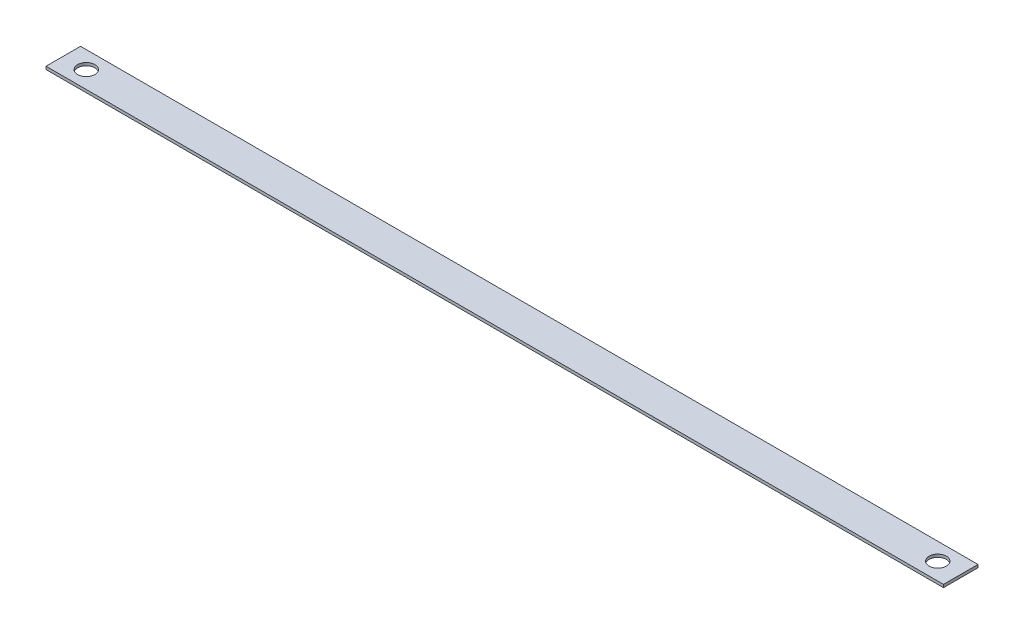
ISO-10303-21;
HEADER;
FILE_DESCRIPTION(('STEP AP214'),'2;1');
FILE_NAME('part.step','',(''),(''),'','','');
FILE_SCHEMA(('AUTOMOTIVE_DESIGN { 1 0 10303 214 1 1 1 1 }'));
ENDSEC;
DATA;
#1=APPLICATION_CONTEXT('core data for automotive mechanical design processes');
#2=APPLICATION_PROTOCOL_DEFINITION('international standard','automotive_design',2000,#1);
#3=PRODUCT_CONTEXT('',#1,'mechanical');
#4=PRODUCT('Part','Part','',(#3));
#5=PRODUCT_RELATED_PRODUCT_CATEGORY('part','',(#4));
#6=PRODUCT_DEFINITION_FORMATION('','',#4);
#7=PRODUCT_DEFINITION_CONTEXT('part definition',#1,'design');
#8=PRODUCT_DEFINITION('design','',#6,#7);
#9=PRODUCT_DEFINITION_SHAPE('','',#8);
#10=(LENGTH_UNIT() NAMED_UNIT(*) SI_UNIT(.MILLI.,.METRE.));
#11=(NAMED_UNIT(*) PLANE_ANGLE_UNIT() SI_UNIT($,.RADIAN.));
#12=(NAMED_UNIT(*) SI_UNIT($,.STERADIAN.) SOLID_ANGLE_UNIT());
#13=UNCERTAINTY_MEASURE_WITH_UNIT(LENGTH_MEASURE(1.E-05),#10,'distance_accuracy_value','');
#14=(GEOMETRIC_REPRESENTATION_CONTEXT(3) GLOBAL_UNCERTAINTY_ASSIGNED_CONTEXT((#13)) GLOBAL_UNIT_ASSIGNED_CONTEXT((#10,
#11,#12)) REPRESENTATION_CONTEXT('',''));
#15=CARTESIAN_POINT('',(0.,0.,0.));
#16=DIRECTION('',(0.,0.,1.));
#17=DIRECTION('',(1.,0.,0.));
#18=AXIS2_PLACEMENT_3D('',#15,#16,#17);
#19=CARTESIAN_POINT('',(0.,3.175,0.));
#20=DIRECTION('',(0.,1.,0.));
#21=DIRECTION('',(0.,0.,1.));
#22=AXIS2_PLACEMENT_3D('',#19,#20,#21);
#23=PLANE('',#22);
#24=CARTESIAN_POINT('',(-469.9,3.175,0.));
#25=DIRECTION('',(0.,1.,0.));
#26=DIRECTION('',(0.,0.,1.));
#27=AXIS2_PLACEMENT_3D('',#24,#25,#26);
#28=CIRCLE('',#27,9.52500000000002);
#29=CARTESIAN_POINT('',(-469.9,3.175,9.52500000000008));
#30=VERTEX_POINT('',#29);
#31=EDGE_CURVE('E100',#30,#30,#28,.T.);
#32=ORIENTED_EDGE('',*,*,#31,.F.);
#33=EDGE_LOOP('',(#32));
#34=FACE_BOUND('',#33,.T.);
#35=DIRECTION('',(0.,0.,1.));
#36=VECTOR('',#35,1.);
#37=CARTESIAN_POINT('',(-495.3,3.175,19.0500000000001));
#38=LINE('',#37,#36);
#39=CARTESIAN_POINT('',(-495.3,3.175,-19.0499999999999));
#40=VERTEX_POINT('',#39);
#41=CARTESIAN_POINT('',(-495.3,3.175,19.0500000000001));
#42=VERTEX_POINT('',#41);
#43=EDGE_CURVE('E85',#40,#42,#38,.T.);
#44=ORIENTED_EDGE('',*,*,#43,.T.);
#45=DIRECTION('',(1.,0.,0.));
#46=VECTOR('',#45,1.);
#47=CARTESIAN_POINT('',(495.3,3.175,19.0499999999999));
#48=LINE('',#47,#46);
#49=CARTESIAN_POINT('',(495.3,3.175,19.0499999999999));
#50=VERTEX_POINT('',#49);
#51=EDGE_CURVE('E80',#42,#50,#48,.T.);
#52=ORIENTED_EDGE('',*,*,#51,.T.);
#53=DIRECTION('',(0.,0.,-1.));
#54=VECTOR('',#53,1.);
#55=CARTESIAN_POINT('',(495.3,3.175,19.0499999999999));
#56=LINE('',#55,#54);
#57=CARTESIAN_POINT('',(495.3,3.175,-19.0500000000001));
#58=VERTEX_POINT('',#57);
#59=EDGE_CURVE('E83',#50,#58,#56,.T.);
#60=ORIENTED_EDGE('',*,*,#59,.T.);
#61=DIRECTION('',(-1.,0.,0.));
#62=VECTOR('',#61,1.);
#63=CARTESIAN_POINT('',(495.3,3.175,-19.0500000000001));
#64=LINE('',#63,#62);
#65=EDGE_CURVE('E50',#58,#40,#64,.T.);
#66=ORIENTED_EDGE('',*,*,#65,.T.);
#67=EDGE_LOOP('',(#44,#52,#60,#66));
#68=FACE_BOUND('',#67,.T.);
#69=CARTESIAN_POINT('',(469.9,3.175,-5.41955410172551E-12));
#70=DIRECTION('',(0.,1.,0.));
#71=DIRECTION('',(0.,0.,-1.));
#72=AXIS2_PLACEMENT_3D('',#69,#70,#71);
#73=CIRCLE('',#72,9.52499999999999);
#74=CARTESIAN_POINT('',(469.9,3.175,-9.52500000000541));
#75=VERTEX_POINT('',#74);
#76=EDGE_CURVE('E115',#75,#75,#73,.T.);
#77=ORIENTED_EDGE('',*,*,#76,.F.);
#78=EDGE_LOOP('',(#77));
#79=FACE_BOUND('',#78,.T.);
#80=ADVANCED_FACE('F33',(#34,#68,#79),#23,.T.);
#81=CARTESIAN_POINT('',(0.,0.,0.));
#82=DIRECTION('',(0.,1.,0.));
#83=DIRECTION('',(0.,0.,1.));
#84=AXIS2_PLACEMENT_3D('',#81,#82,#83);
#85=PLANE('',#84);
#86=DIRECTION('',(0.,0.,1.));
#87=VECTOR('',#86,1.);
#88=CARTESIAN_POINT('',(-495.3,0.,19.0500000000001));
#89=LINE('',#88,#87);
#90=CARTESIAN_POINT('',(-495.3,0.,-19.0499999999999));
#91=VERTEX_POINT('',#90);
#92=CARTESIAN_POINT('',(-495.3,0.,19.0500000000001));
#93=VERTEX_POINT('',#92);
#94=EDGE_CURVE('E97',#91,#93,#89,.T.);
#95=ORIENTED_EDGE('',*,*,#94,.F.);
#96=DIRECTION('',(-1.,0.,0.));
#97=VECTOR('',#96,1.);
#98=CARTESIAN_POINT('',(495.3,0.,-19.0500000000001));
#99=LINE('',#98,#97);
#100=CARTESIAN_POINT('',(495.3,0.,-19.0500000000001));
#101=VERTEX_POINT('',#100);
#102=EDGE_CURVE('E73',#101,#91,#99,.T.);
#103=ORIENTED_EDGE('',*,*,#102,.F.);
#104=DIRECTION('',(0.,0.,-1.));
#105=VECTOR('',#104,1.);
#106=CARTESIAN_POINT('',(495.3,0.,19.0499999999999));
#107=LINE('',#106,#105);
#108=CARTESIAN_POINT('',(495.3,0.,19.0499999999999));
#109=VERTEX_POINT('',#108);
#110=EDGE_CURVE('E67',#109,#101,#107,.T.);
#111=ORIENTED_EDGE('',*,*,#110,.F.);
#112=DIRECTION('',(1.,0.,0.));
#113=VECTOR('',#112,1.);
#114=CARTESIAN_POINT('',(495.3,0.,19.0499999999999));
#115=LINE('',#114,#113);
#116=EDGE_CURVE('E89',#93,#109,#115,.T.);
#117=ORIENTED_EDGE('',*,*,#116,.F.);
#118=EDGE_LOOP('',(#95,#103,#111,#117));
#119=FACE_BOUND('',#118,.T.);
#120=CARTESIAN_POINT('',(-469.9,0.,0.));
#121=DIRECTION('',(0.,1.,0.));
#122=DIRECTION('',(0.,0.,1.));
#123=AXIS2_PLACEMENT_3D('',#120,#121,#122);
#124=CIRCLE('',#123,9.52500000000002);
#125=CARTESIAN_POINT('',(-469.9,0.,9.52500000000008));
#126=VERTEX_POINT('',#125);
#127=EDGE_CURVE('E112',#126,#126,#124,.T.);
#128=ORIENTED_EDGE('',*,*,#127,.T.);
#129=EDGE_LOOP('',(#128));
#130=FACE_BOUND('',#129,.T.);
#131=CARTESIAN_POINT('',(469.9,0.,-5.41955410172551E-12));
#132=DIRECTION('',(0.,1.,0.));
#133=DIRECTION('',(0.,0.,-1.));
#134=AXIS2_PLACEMENT_3D('',#131,#132,#133);
#135=CIRCLE('',#134,9.52499999999999);
#136=CARTESIAN_POINT('',(469.9,0.,-9.52500000000541));
#137=VERTEX_POINT('',#136);
#138=EDGE_CURVE('E118',#137,#137,#135,.T.);
#139=ORIENTED_EDGE('',*,*,#138,.T.);
#140=EDGE_LOOP('',(#139));
#141=FACE_BOUND('',#140,.T.);
#142=ADVANCED_FACE('F108',(#119,#130,#141),#85,.F.);
#143=CARTESIAN_POINT('',(-495.3,3.175,19.0500000000001));
#144=DIRECTION('',(1.,0.,0.));
#145=DIRECTION('',(0.,0.,-1.));
#146=AXIS2_PLACEMENT_3D('',#143,#144,#145);
#147=PLANE('',#146);
#148=ORIENTED_EDGE('',*,*,#94,.T.);
#149=DIRECTION('',(0.,-1.,0.));
#150=VECTOR('',#149,1.);
#151=CARTESIAN_POINT('',(-495.3,3.175,19.0500000000001));
#152=LINE('',#151,#150);
#153=EDGE_CURVE('E11',#42,#93,#152,.T.);
#154=ORIENTED_EDGE('',*,*,#153,.F.);
#155=ORIENTED_EDGE('',*,*,#43,.F.);
#156=DIRECTION('',(0.,-1.,0.));
#157=VECTOR('',#156,1.);
#158=CARTESIAN_POINT('',(-495.3,3.175,-19.0499999999999));
#159=LINE('',#158,#157);
#160=EDGE_CURVE('E93',#40,#91,#159,.T.);
#161=ORIENTED_EDGE('',*,*,#160,.T.);
#162=EDGE_LOOP('',(#148,#154,#155,#161));
#163=FACE_BOUND('',#162,.T.);
#164=ADVANCED_FACE('F35',(#163),#147,.F.);
#165=CARTESIAN_POINT('',(495.3,3.175,19.0499999999999));
#166=DIRECTION('',(0.,0.,-1.));
#167=DIRECTION('',(-1.,0.,0.));
#168=AXIS2_PLACEMENT_3D('',#165,#166,#167);
#169=PLANE('',#168);
#170=ORIENTED_EDGE('',*,*,#116,.T.);
#171=DIRECTION('',(0.,-1.,0.));
#172=VECTOR('',#171,1.);
#173=CARTESIAN_POINT('',(495.3,3.175,19.0499999999999));
#174=LINE('',#173,#172);
#175=EDGE_CURVE('E42',#50,#109,#174,.T.);
#176=ORIENTED_EDGE('',*,*,#175,.F.);
#177=ORIENTED_EDGE('',*,*,#51,.F.);
#178=ORIENTED_EDGE('',*,*,#153,.T.);
#179=EDGE_LOOP('',(#170,#176,#177,#178));
#180=FACE_BOUND('',#179,.T.);
#181=ADVANCED_FACE('F88',(#180),#169,.F.);
#182=CARTESIAN_POINT('',(495.3,3.175,19.0499999999999));
#183=DIRECTION('',(-1.,0.,0.));
#184=DIRECTION('',(0.,0.,1.));
#185=AXIS2_PLACEMENT_3D('',#182,#183,#184);
#186=PLANE('',#185);
#187=ORIENTED_EDGE('',*,*,#110,.T.);
#188=DIRECTION('',(0.,-1.,0.));
#189=VECTOR('',#188,1.);
#190=CARTESIAN_POINT('',(495.3,3.175,-19.0500000000001));
#191=LINE('',#190,#189);
#192=EDGE_CURVE('E90',#58,#101,#191,.T.);
#193=ORIENTED_EDGE('',*,*,#192,.F.);
#194=ORIENTED_EDGE('',*,*,#59,.F.);
#195=ORIENTED_EDGE('',*,*,#175,.T.);
#196=EDGE_LOOP('',(#187,#193,#194,#195));
#197=FACE_BOUND('',#196,.T.);
#198=ADVANCED_FACE('F91',(#197),#186,.F.);
#199=CARTESIAN_POINT('',(495.3,3.175,-19.0500000000001));
#200=DIRECTION('',(0.,0.,1.));
#201=DIRECTION('',(1.,0.,0.));
#202=AXIS2_PLACEMENT_3D('',#199,#200,#201);
#203=PLANE('',#202);
#204=ORIENTED_EDGE('',*,*,#102,.T.);
#205=ORIENTED_EDGE('',*,*,#160,.F.);
#206=ORIENTED_EDGE('',*,*,#65,.F.);
#207=ORIENTED_EDGE('',*,*,#192,.T.);
#208=EDGE_LOOP('',(#204,#205,#206,#207));
#209=FACE_BOUND('',#208,.T.);
#210=ADVANCED_FACE('F105',(#209),#203,.F.);
#211=CARTESIAN_POINT('',(-469.9,3.175,0.));
#212=DIRECTION('',(0.,-1.,0.));
#213=DIRECTION('',(0.,0.,-1.));
#214=AXIS2_PLACEMENT_3D('',#211,#212,#213);
#215=CYLINDRICAL_SURFACE('',#214,9.52500000000002);
#216=ORIENTED_EDGE('',*,*,#31,.T.);
#217=EDGE_LOOP('',(#216));
#218=FACE_BOUND('',#217,.T.);
#219=ORIENTED_EDGE('',*,*,#127,.F.);
#220=EDGE_LOOP('',(#219));
#221=FACE_BOUND('',#220,.T.);
#222=ADVANCED_FACE('F135',(#218,#221),#215,.F.);
#223=CARTESIAN_POINT('',(469.9,3.175,-5.41955410172551E-12));
#224=DIRECTION('',(0.,-1.,0.));
#225=DIRECTION('',(0.,0.,-1.));
#226=AXIS2_PLACEMENT_3D('',#223,#224,#225);
#227=CYLINDRICAL_SURFACE('',#226,9.52499999999999);
#228=ORIENTED_EDGE('',*,*,#76,.T.);
#229=EDGE_LOOP('',(#228));
#230=FACE_BOUND('',#229,.T.);
#231=ORIENTED_EDGE('',*,*,#138,.F.);
#232=EDGE_LOOP('',(#231));
#233=FACE_BOUND('',#232,.T.);
#234=ADVANCED_FACE('F124',(#230,#233),#227,.F.);
#235=CLOSED_SHELL('',(#80,#142,#164,#181,#198,#210,#222,#234));
#236=MANIFOLD_SOLID_BREP('B2',#235);
#237=ADVANCED_BREP_SHAPE_REPRESENTATION('',(#18,#236),#14);
#238=SHAPE_DEFINITION_REPRESENTATION(#9,#237);
ENDSEC;
END-ISO-10303-21;
